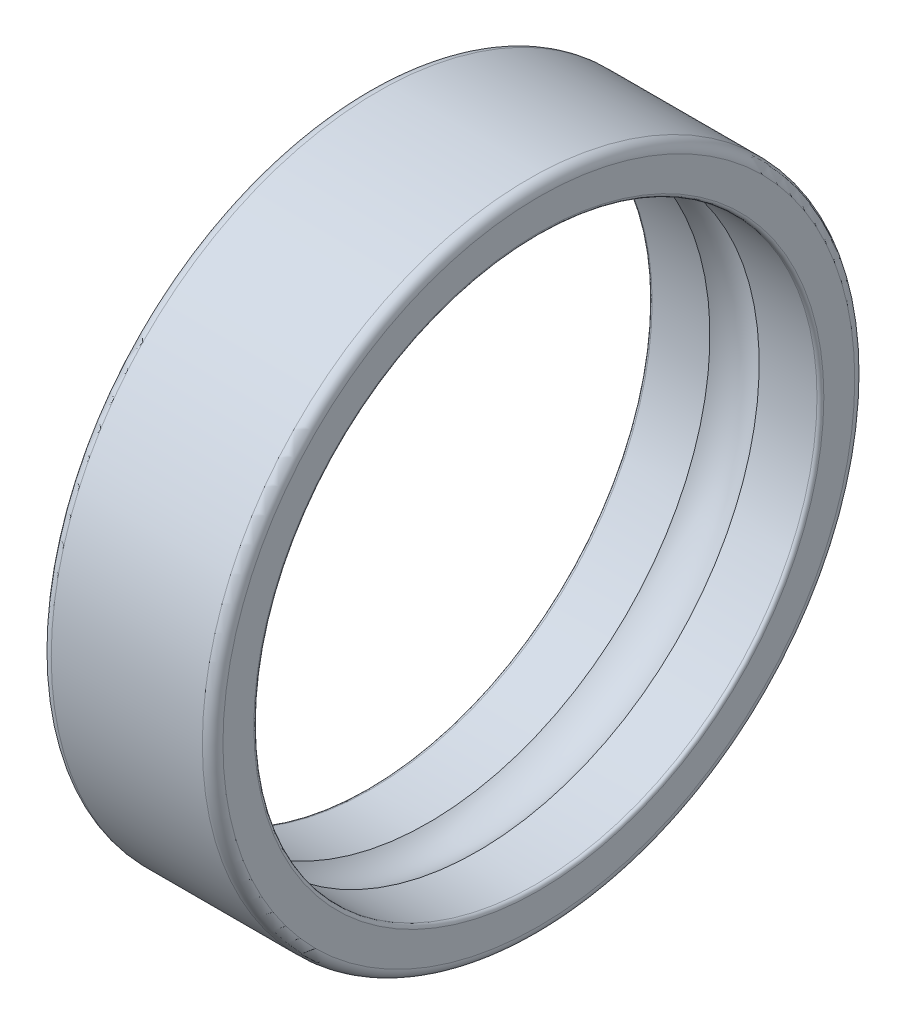
ISO-10303-21;
HEADER;
FILE_DESCRIPTION(('STEP AP214'),'2;1');
FILE_NAME('part.step','',(''),(''),'','','');
FILE_SCHEMA(('AUTOMOTIVE_DESIGN { 1 0 10303 214 1 1 1 1 }'));
ENDSEC;
DATA;
#1=APPLICATION_CONTEXT('core data for automotive mechanical design processes');
#2=APPLICATION_PROTOCOL_DEFINITION('international standard','automotive_design',2000,#1);
#3=PRODUCT_CONTEXT('',#1,'mechanical');
#4=PRODUCT('Part','Part','',(#3));
#5=PRODUCT_RELATED_PRODUCT_CATEGORY('part','',(#4));
#6=PRODUCT_DEFINITION_FORMATION('','',#4);
#7=PRODUCT_DEFINITION_CONTEXT('part definition',#1,'design');
#8=PRODUCT_DEFINITION('design','',#6,#7);
#9=PRODUCT_DEFINITION_SHAPE('','',#8);
#10=(LENGTH_UNIT() NAMED_UNIT(*) SI_UNIT(.MILLI.,.METRE.));
#11=(NAMED_UNIT(*) PLANE_ANGLE_UNIT() SI_UNIT($,.RADIAN.));
#12=(NAMED_UNIT(*) SI_UNIT($,.STERADIAN.) SOLID_ANGLE_UNIT());
#13=UNCERTAINTY_MEASURE_WITH_UNIT(LENGTH_MEASURE(1.E-05),#10,'distance_accuracy_value','');
#14=(GEOMETRIC_REPRESENTATION_CONTEXT(3) GLOBAL_UNCERTAINTY_ASSIGNED_CONTEXT((#13)) GLOBAL_UNIT_ASSIGNED_CONTEXT((#10,
#11,#12)) REPRESENTATION_CONTEXT('',''));
#15=CARTESIAN_POINT('',(0.,0.,0.));
#16=DIRECTION('',(0.,0.,1.));
#17=DIRECTION('',(1.,0.,0.));
#18=AXIS2_PLACEMENT_3D('',#15,#16,#17);
#19=CARTESIAN_POINT('',(0.,0.,0.));
#20=DIRECTION('',(1.,0.,0.));
#21=DIRECTION('',(0.,0.,-1.));
#22=AXIS2_PLACEMENT_3D('',#19,#20,#21);
#23=TOROIDAL_SURFACE('',#22,7.25,1.1905);
#24=CARTESIAN_POINT('',(0.717488850087582,0.,0.));
#25=DIRECTION('',(-1.,0.,0.));
#26=DIRECTION('',(0.,0.,1.));
#27=AXIS2_PLACEMENT_3D('',#24,#25,#26);
#28=CIRCLE('',#27,8.2);
#29=CARTESIAN_POINT('',(0.717488850087582,0.,8.2));
#30=VERTEX_POINT('',#29);
#31=EDGE_CURVE('E142',#30,#30,#28,.F.);
#32=ORIENTED_EDGE('',*,*,#31,.T.);
#33=EDGE_LOOP('',(#32));
#34=FACE_BOUND('',#33,.T.);
#35=CARTESIAN_POINT('',(-0.717488850087582,0.,0.));
#36=DIRECTION('',(-1.,0.,0.));
#37=DIRECTION('',(0.,0.,1.));
#38=AXIS2_PLACEMENT_3D('',#35,#36,#37);
#39=CIRCLE('',#38,8.2);
#40=CARTESIAN_POINT('',(-0.717488850087582,0.,8.2));
#41=VERTEX_POINT('',#40);
#42=EDGE_CURVE('E135',#41,#41,#39,.T.);
#43=ORIENTED_EDGE('',*,*,#42,.T.);
#44=EDGE_LOOP('',(#43));
#45=FACE_BOUND('',#44,.T.);
#46=ADVANCED_FACE('F14',(#34,#45),#23,.F.);
#47=CARTESIAN_POINT('',(2.5,0.,0.));
#48=DIRECTION('',(-1.,0.,0.));
#49=DIRECTION('',(0.,0.,1.));
#50=AXIS2_PLACEMENT_3D('',#47,#48,#49);
#51=CYLINDRICAL_SURFACE('',#50,8.2);
#52=ORIENTED_EDGE('',*,*,#31,.F.);
#53=EDGE_LOOP('',(#52));
#54=FACE_BOUND('',#53,.T.);
#55=CARTESIAN_POINT('',(2.4,0.,0.));
#56=DIRECTION('',(1.,0.,0.));
#57=DIRECTION('',(0.,0.,-1.));
#58=AXIS2_PLACEMENT_3D('',#55,#56,#57);
#59=CIRCLE('',#58,8.2);
#60=CARTESIAN_POINT('',(2.4,0.,-8.2));
#61=VERTEX_POINT('',#60);
#62=EDGE_CURVE('E107',#61,#61,#59,.F.);
#63=ORIENTED_EDGE('',*,*,#62,.F.);
#64=EDGE_LOOP('',(#63));
#65=FACE_BOUND('',#64,.T.);
#66=ADVANCED_FACE('F148',(#54,#65),#51,.F.);
#67=CARTESIAN_POINT('',(2.5,0.,0.));
#68=DIRECTION('',(-1.,0.,0.));
#69=DIRECTION('',(0.,0.,1.));
#70=AXIS2_PLACEMENT_3D('',#67,#68,#69);
#71=CYLINDRICAL_SURFACE('',#70,8.2);
#72=CARTESIAN_POINT('',(-2.4,0.,0.));
#73=DIRECTION('',(1.,0.,0.));
#74=DIRECTION('',(0.,0.,-1.));
#75=AXIS2_PLACEMENT_3D('',#72,#73,#74);
#76=CIRCLE('',#75,8.2);
#77=CARTESIAN_POINT('',(-2.4,0.,-8.2));
#78=VERTEX_POINT('',#77);
#79=EDGE_CURVE('E103',#78,#78,#76,.T.);
#80=ORIENTED_EDGE('',*,*,#79,.F.);
#81=EDGE_LOOP('',(#80));
#82=FACE_BOUND('',#81,.T.);
#83=ORIENTED_EDGE('',*,*,#42,.F.);
#84=EDGE_LOOP('',(#83));
#85=FACE_BOUND('',#84,.T.);
#86=ADVANCED_FACE('F128',(#82,#85),#71,.F.);
#87=CARTESIAN_POINT('',(2.4,0.,0.));
#88=DIRECTION('',(1.,0.,0.));
#89=DIRECTION('',(0.,0.,-1.));
#90=AXIS2_PLACEMENT_3D('',#87,#88,#89);
#91=TOROIDAL_SURFACE('',#90,8.30000000000001,0.100000000000005);
#92=ORIENTED_EDGE('',*,*,#62,.T.);
#93=EDGE_LOOP('',(#92));
#94=FACE_BOUND('',#93,.T.);
#95=CARTESIAN_POINT('',(2.5,0.,0.));
#96=DIRECTION('',(1.,0.,0.));
#97=DIRECTION('',(0.,0.,-1.));
#98=AXIS2_PLACEMENT_3D('',#95,#96,#97);
#99=CIRCLE('',#98,8.30000000000001);
#100=CARTESIAN_POINT('',(2.5,0.,-8.30000000000001));
#101=VERTEX_POINT('',#100);
#102=EDGE_CURVE('E106',#101,#101,#99,.F.);
#103=ORIENTED_EDGE('',*,*,#102,.F.);
#104=EDGE_LOOP('',(#103));
#105=FACE_BOUND('',#104,.T.);
#106=ADVANCED_FACE('F124',(#94,#105),#91,.T.);
#107=CARTESIAN_POINT('',(-2.4,0.,0.));
#108=DIRECTION('',(1.,0.,0.));
#109=DIRECTION('',(0.,0.,-1.));
#110=AXIS2_PLACEMENT_3D('',#107,#108,#109);
#111=TOROIDAL_SURFACE('',#110,8.30000000000001,0.100000000000003);
#112=CARTESIAN_POINT('',(-2.5,0.,0.));
#113=DIRECTION('',(-1.,0.,0.));
#114=DIRECTION('',(0.,0.,-1.));
#115=AXIS2_PLACEMENT_3D('',#112,#113,#114);
#116=CIRCLE('',#115,8.3);
#117=CARTESIAN_POINT('',(-2.5,0.,-8.3));
#118=VERTEX_POINT('',#117);
#119=EDGE_CURVE('E112',#118,#118,#116,.F.);
#120=ORIENTED_EDGE('',*,*,#119,.F.);
#121=EDGE_LOOP('',(#120));
#122=FACE_BOUND('',#121,.T.);
#123=ORIENTED_EDGE('',*,*,#79,.T.);
#124=EDGE_LOOP('',(#123));
#125=FACE_BOUND('',#124,.T.);
#126=ADVANCED_FACE('F77',(#122,#125),#111,.T.);
#127=CARTESIAN_POINT('',(2.5,8.3,0.));
#128=DIRECTION('',(1.,0.,0.));
#129=DIRECTION('',(0.,0.,-1.));
#130=AXIS2_PLACEMENT_3D('',#127,#128,#129);
#131=PLANE('',#130);
#132=ORIENTED_EDGE('',*,*,#102,.T.);
#133=EDGE_LOOP('',(#132));
#134=FACE_BOUND('',#133,.T.);
#135=CARTESIAN_POINT('',(2.5,0.,0.));
#136=DIRECTION('',(-1.,0.,0.));
#137=DIRECTION('',(0.,0.,-1.));
#138=AXIS2_PLACEMENT_3D('',#135,#136,#137);
#139=CIRCLE('',#138,9.2);
#140=CARTESIAN_POINT('',(2.5,0.,-9.2));
#141=VERTEX_POINT('',#140);
#142=EDGE_CURVE('E60',#141,#141,#139,.T.);
#143=ORIENTED_EDGE('',*,*,#142,.F.);
#144=EDGE_LOOP('',(#143));
#145=FACE_BOUND('',#144,.T.);
#146=ADVANCED_FACE('F67',(#134,#145),#131,.T.);
#147=CARTESIAN_POINT('',(-2.5,9.2,0.));
#148=DIRECTION('',(-1.,0.,0.));
#149=DIRECTION('',(0.,0.,1.));
#150=AXIS2_PLACEMENT_3D('',#147,#148,#149);
#151=PLANE('',#150);
#152=CARTESIAN_POINT('',(-2.5,0.,0.));
#153=DIRECTION('',(1.,0.,0.));
#154=DIRECTION('',(0.,0.,-1.));
#155=AXIS2_PLACEMENT_3D('',#152,#153,#154);
#156=CIRCLE('',#155,9.2);
#157=CARTESIAN_POINT('',(-2.5,0.,-9.2));
#158=VERTEX_POINT('',#157);
#159=EDGE_CURVE('E26',#158,#158,#156,.T.);
#160=ORIENTED_EDGE('',*,*,#159,.F.);
#161=EDGE_LOOP('',(#160));
#162=FACE_BOUND('',#161,.T.);
#163=ORIENTED_EDGE('',*,*,#119,.T.);
#164=EDGE_LOOP('',(#163));
#165=FACE_BOUND('',#164,.T.);
#166=ADVANCED_FACE('F76',(#162,#165),#151,.T.);
#167=CARTESIAN_POINT('',(2.2,0.,0.));
#168=DIRECTION('',(1.,0.,0.));
#169=DIRECTION('',(0.,0.,-1.));
#170=AXIS2_PLACEMENT_3D('',#167,#168,#169);
#171=TOROIDAL_SURFACE('',#170,9.2,0.300000000000003);
#172=ORIENTED_EDGE('',*,*,#142,.T.);
#173=EDGE_LOOP('',(#172));
#174=FACE_BOUND('',#173,.T.);
#175=CARTESIAN_POINT('',(2.2,0.,0.));
#176=DIRECTION('',(-1.,0.,0.));
#177=DIRECTION('',(0.,0.,1.));
#178=AXIS2_PLACEMENT_3D('',#175,#176,#177);
#179=CIRCLE('',#178,9.5);
#180=CARTESIAN_POINT('',(2.2,0.,9.5));
#181=VERTEX_POINT('',#180);
#182=EDGE_CURVE('E21',#181,#181,#179,.T.);
#183=ORIENTED_EDGE('',*,*,#182,.F.);
#184=EDGE_LOOP('',(#183));
#185=FACE_BOUND('',#184,.T.);
#186=ADVANCED_FACE('F40',(#174,#185),#171,.T.);
#187=CARTESIAN_POINT('',(-2.2,0.,0.));
#188=DIRECTION('',(1.,0.,0.));
#189=DIRECTION('',(0.,0.,-1.));
#190=AXIS2_PLACEMENT_3D('',#187,#188,#189);
#191=TOROIDAL_SURFACE('',#190,9.2,0.300000000000002);
#192=CARTESIAN_POINT('',(-2.2,0.,0.));
#193=DIRECTION('',(-1.,0.,0.));
#194=DIRECTION('',(0.,0.,1.));
#195=AXIS2_PLACEMENT_3D('',#192,#193,#194);
#196=CIRCLE('',#195,9.5);
#197=CARTESIAN_POINT('',(-2.2,0.,9.5));
#198=VERTEX_POINT('',#197);
#199=EDGE_CURVE('E10',#198,#198,#196,.F.);
#200=ORIENTED_EDGE('',*,*,#199,.F.);
#201=EDGE_LOOP('',(#200));
#202=FACE_BOUND('',#201,.T.);
#203=ORIENTED_EDGE('',*,*,#159,.T.);
#204=EDGE_LOOP('',(#203));
#205=FACE_BOUND('',#204,.T.);
#206=ADVANCED_FACE('F34',(#202,#205),#191,.T.);
#207=CARTESIAN_POINT('',(2.5,0.,0.));
#208=DIRECTION('',(-1.,0.,0.));
#209=DIRECTION('',(0.,0.,1.));
#210=AXIS2_PLACEMENT_3D('',#207,#208,#209);
#211=CYLINDRICAL_SURFACE('',#210,9.5);
#212=ORIENTED_EDGE('',*,*,#182,.T.);
#213=EDGE_LOOP('',(#212));
#214=FACE_BOUND('',#213,.T.);
#215=ORIENTED_EDGE('',*,*,#199,.T.);
#216=EDGE_LOOP('',(#215));
#217=FACE_BOUND('',#216,.T.);
#218=ADVANCED_FACE('F39',(#214,#217),#211,.T.);
#219=CLOSED_SHELL('',(#46,#66,#86,#106,#126,#146,#166,#186,#206,#218));
#220=MANIFOLD_SOLID_BREP('B1',#219);
#221=ADVANCED_BREP_SHAPE_REPRESENTATION('',(#18,#220),#14);
#222=SHAPE_DEFINITION_REPRESENTATION(#9,#221);
ENDSEC;
END-ISO-10303-21;
